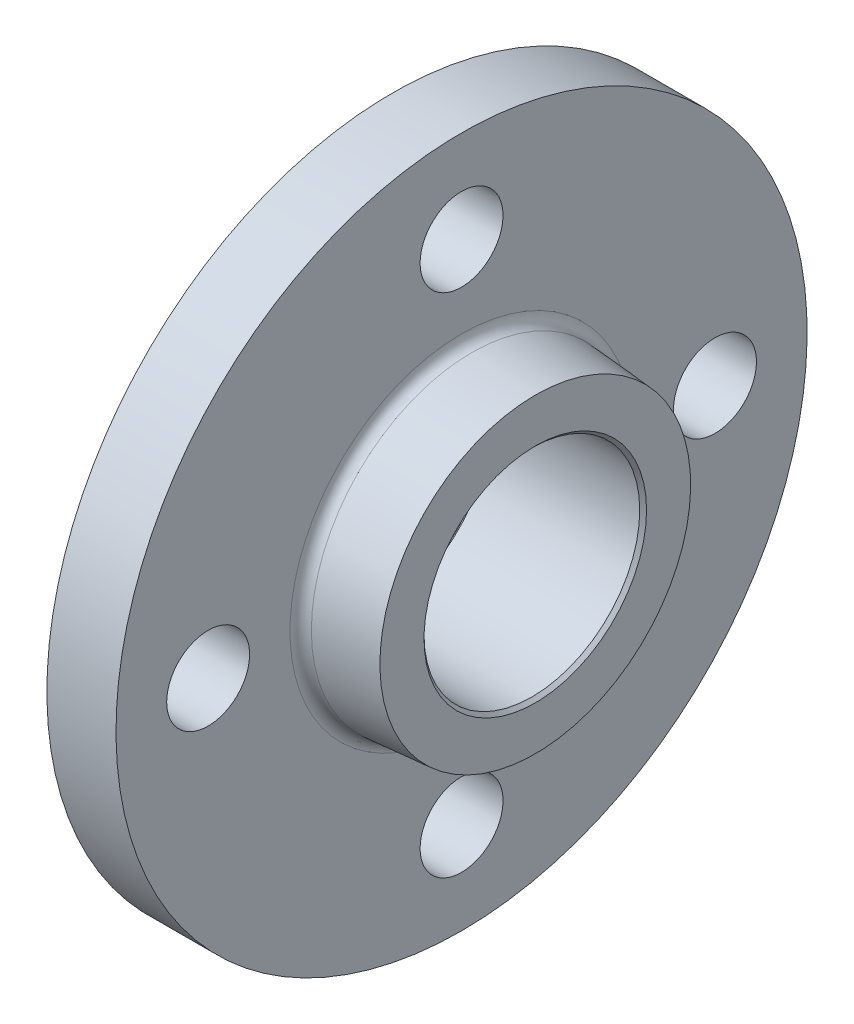
ISO-10303-21;
HEADER;
FILE_DESCRIPTION(('STEP AP214'),'2;1');
FILE_NAME('part.step','',(''),(''),'','','');
FILE_SCHEMA(('AUTOMOTIVE_DESIGN { 1 0 10303 214 1 1 1 1 }'));
ENDSEC;
DATA;
#1=APPLICATION_CONTEXT('core data for automotive mechanical design processes');
#2=APPLICATION_PROTOCOL_DEFINITION('international standard','automotive_design',2000,#1);
#3=PRODUCT_CONTEXT('',#1,'mechanical');
#4=PRODUCT('Part','Part','',(#3));
#5=PRODUCT_RELATED_PRODUCT_CATEGORY('part','',(#4));
#6=PRODUCT_DEFINITION_FORMATION('','',#4);
#7=PRODUCT_DEFINITION_CONTEXT('part definition',#1,'design');
#8=PRODUCT_DEFINITION('design','',#6,#7);
#9=PRODUCT_DEFINITION_SHAPE('','',#8);
#10=(LENGTH_UNIT() NAMED_UNIT(*) SI_UNIT(.MILLI.,.METRE.));
#11=(NAMED_UNIT(*) PLANE_ANGLE_UNIT() SI_UNIT($,.RADIAN.));
#12=(NAMED_UNIT(*) SI_UNIT($,.STERADIAN.) SOLID_ANGLE_UNIT());
#13=UNCERTAINTY_MEASURE_WITH_UNIT(LENGTH_MEASURE(1.E-05),#10,'distance_accuracy_value','');
#14=(GEOMETRIC_REPRESENTATION_CONTEXT(3) GLOBAL_UNCERTAINTY_ASSIGNED_CONTEXT((#13)) GLOBAL_UNIT_ASSIGNED_CONTEXT((#10,
#11,#12)) REPRESENTATION_CONTEXT('',''));
#15=CARTESIAN_POINT('',(0.,0.,0.));
#16=DIRECTION('',(0.,0.,1.));
#17=DIRECTION('',(1.,0.,0.));
#18=AXIS2_PLACEMENT_3D('',#15,#16,#17);
#19=CARTESIAN_POINT('',(18.,0.,0.));
#20=DIRECTION('',(-1.,0.,0.));
#21=DIRECTION('',(0.,-1.,0.));
#22=AXIS2_PLACEMENT_3D('',#19,#20,#21);
#23=CYLINDRICAL_SURFACE('',#22,75.);
#24=CARTESIAN_POINT('',(18.,0.,0.));
#25=DIRECTION('',(-1.,0.,0.));
#26=DIRECTION('',(0.,-1.,0.));
#27=AXIS2_PLACEMENT_3D('',#24,#25,#26);
#28=CIRCLE('',#27,75.);
#29=CARTESIAN_POINT('',(18.,-75.,0.));
#30=VERTEX_POINT('',#29);
#31=EDGE_CURVE('E59',#30,#30,#28,.T.);
#32=ORIENTED_EDGE('',*,*,#31,.T.);
#33=EDGE_LOOP('',(#32));
#34=FACE_BOUND('',#33,.T.);
#35=CARTESIAN_POINT('',(3.,0.,0.));
#36=DIRECTION('',(-1.,0.,0.));
#37=DIRECTION('',(0.,-1.,0.));
#38=AXIS2_PLACEMENT_3D('',#35,#36,#37);
#39=CIRCLE('',#38,75.);
#40=CARTESIAN_POINT('',(3.,-75.,0.));
#41=VERTEX_POINT('',#40);
#42=EDGE_CURVE('E62',#41,#41,#39,.T.);
#43=ORIENTED_EDGE('',*,*,#42,.F.);
#44=EDGE_LOOP('',(#43));
#45=FACE_BOUND('',#44,.T.);
#46=ADVANCED_FACE('F32',(#34,#45),#23,.T.);
#47=CARTESIAN_POINT('',(18.,75.,0.));
#48=DIRECTION('',(1.,0.,0.));
#49=DIRECTION('',(0.,1.,0.));
#50=AXIS2_PLACEMENT_3D('',#47,#48,#49);
#51=PLANE('',#50);
#52=CARTESIAN_POINT('',(18.,0.,0.));
#53=DIRECTION('',(1.,0.,0.));
#54=DIRECTION('',(0.,1.,0.));
#55=AXIS2_PLACEMENT_3D('',#52,#53,#54);
#56=CIRCLE('',#55,37.2295156746098);
#57=CARTESIAN_POINT('',(18.,37.2295156746098,0.));
#58=VERTEX_POINT('',#57);
#59=EDGE_CURVE('E10',#58,#58,#56,.F.);
#60=ORIENTED_EDGE('',*,*,#59,.T.);
#61=EDGE_LOOP('',(#60));
#62=FACE_BOUND('',#61,.T.);
#63=CARTESIAN_POINT('',(18.,-55.,0.));
#64=DIRECTION('',(1.,0.,0.));
#65=DIRECTION('',(0.,1.,0.));
#66=AXIS2_PLACEMENT_3D('',#63,#64,#65);
#67=CIRCLE('',#66,8.99999999999999);
#68=CARTESIAN_POINT('',(18.,-46.,0.));
#69=VERTEX_POINT('',#68);
#70=EDGE_CURVE('E91',#69,#69,#67,.T.);
#71=ORIENTED_EDGE('',*,*,#70,.F.);
#72=EDGE_LOOP('',(#71));
#73=FACE_BOUND('',#72,.T.);
#74=CARTESIAN_POINT('',(18.,0.,-55.));
#75=DIRECTION('',(1.,0.,0.));
#76=DIRECTION('',(0.,1.,0.));
#77=AXIS2_PLACEMENT_3D('',#74,#75,#76);
#78=CIRCLE('',#77,8.99999999999999);
#79=CARTESIAN_POINT('',(18.,8.99999999999998,-55.));
#80=VERTEX_POINT('',#79);
#81=EDGE_CURVE('E85',#80,#80,#78,.T.);
#82=ORIENTED_EDGE('',*,*,#81,.F.);
#83=EDGE_LOOP('',(#82));
#84=FACE_BOUND('',#83,.T.);
#85=CARTESIAN_POINT('',(18.,55.,0.));
#86=DIRECTION('',(1.,0.,0.));
#87=DIRECTION('',(0.,1.,0.));
#88=AXIS2_PLACEMENT_3D('',#85,#86,#87);
#89=CIRCLE('',#88,8.99999999999999);
#90=CARTESIAN_POINT('',(18.,64.,0.));
#91=VERTEX_POINT('',#90);
#92=EDGE_CURVE('E79',#91,#91,#89,.T.);
#93=ORIENTED_EDGE('',*,*,#92,.F.);
#94=EDGE_LOOP('',(#93));
#95=FACE_BOUND('',#94,.T.);
#96=CARTESIAN_POINT('',(18.,0.,55.));
#97=DIRECTION('',(1.,0.,0.));
#98=DIRECTION('',(0.,1.,0.));
#99=AXIS2_PLACEMENT_3D('',#96,#97,#98);
#100=CIRCLE('',#99,8.99999999999999);
#101=CARTESIAN_POINT('',(18.,9.,55.));
#102=VERTEX_POINT('',#101);
#103=EDGE_CURVE('E73',#102,#102,#100,.T.);
#104=ORIENTED_EDGE('',*,*,#103,.F.);
#105=EDGE_LOOP('',(#104));
#106=FACE_BOUND('',#105,.T.);
#107=ORIENTED_EDGE('',*,*,#31,.F.);
#108=EDGE_LOOP('',(#107));
#109=FACE_BOUND('',#108,.T.);
#110=ADVANCED_FACE('F104',(#62,#73,#84,#95,#106,#109),#51,.T.);
#111=CARTESIAN_POINT('',(3.,0.,0.));
#112=DIRECTION('',(-1.,0.,0.));
#113=DIRECTION('',(0.,-1.,0.));
#114=AXIS2_PLACEMENT_3D('',#111,#112,#113);
#115=PLANE('',#114);
#116=CARTESIAN_POINT('',(3.,-55.,0.));
#117=DIRECTION('',(-1.,0.,0.));
#118=DIRECTION('',(0.,0.,1.));
#119=AXIS2_PLACEMENT_3D('',#116,#117,#118);
#120=CIRCLE('',#119,8.99999999999999);
#121=CARTESIAN_POINT('',(3.,-55.,8.99999999999999));
#122=VERTEX_POINT('',#121);
#123=EDGE_CURVE('E94',#122,#122,#120,.T.);
#124=ORIENTED_EDGE('',*,*,#123,.F.);
#125=EDGE_LOOP('',(#124));
#126=FACE_BOUND('',#125,.T.);
#127=CARTESIAN_POINT('',(3.,0.,-55.));
#128=DIRECTION('',(-1.,0.,0.));
#129=DIRECTION('',(0.,0.,1.));
#130=AXIS2_PLACEMENT_3D('',#127,#128,#129);
#131=CIRCLE('',#130,8.99999999999999);
#132=CARTESIAN_POINT('',(3.,0.,-46.));
#133=VERTEX_POINT('',#132);
#134=EDGE_CURVE('E88',#133,#133,#131,.T.);
#135=ORIENTED_EDGE('',*,*,#134,.F.);
#136=EDGE_LOOP('',(#135));
#137=FACE_BOUND('',#136,.T.);
#138=CARTESIAN_POINT('',(2.99999999999999,55.,0.));
#139=DIRECTION('',(-1.,0.,0.));
#140=DIRECTION('',(0.,0.,1.));
#141=AXIS2_PLACEMENT_3D('',#138,#139,#140);
#142=CIRCLE('',#141,8.99999999999999);
#143=CARTESIAN_POINT('',(2.99999999999999,55.,8.99999999999998));
#144=VERTEX_POINT('',#143);
#145=EDGE_CURVE('E82',#144,#144,#142,.T.);
#146=ORIENTED_EDGE('',*,*,#145,.F.);
#147=EDGE_LOOP('',(#146));
#148=FACE_BOUND('',#147,.T.);
#149=CARTESIAN_POINT('',(3.,0.,55.));
#150=DIRECTION('',(-1.,0.,0.));
#151=DIRECTION('',(0.,0.,1.));
#152=AXIS2_PLACEMENT_3D('',#149,#150,#151);
#153=CIRCLE('',#152,8.99999999999999);
#154=CARTESIAN_POINT('',(3.,0.,64.));
#155=VERTEX_POINT('',#154);
#156=EDGE_CURVE('E76',#155,#155,#153,.T.);
#157=ORIENTED_EDGE('',*,*,#156,.F.);
#158=EDGE_LOOP('',(#157));
#159=FACE_BOUND('',#158,.T.);
#160=CARTESIAN_POINT('',(3.,0.,0.));
#161=DIRECTION('',(-1.,0.,0.));
#162=DIRECTION('',(0.,-1.,0.));
#163=AXIS2_PLACEMENT_3D('',#160,#161,#162);
#164=CIRCLE('',#163,44.);
#165=CARTESIAN_POINT('',(3.,-44.,0.));
#166=VERTEX_POINT('',#165);
#167=EDGE_CURVE('E58',#166,#166,#164,.T.);
#168=ORIENTED_EDGE('',*,*,#167,.F.);
#169=EDGE_LOOP('',(#168));
#170=FACE_BOUND('',#169,.T.);
#171=ORIENTED_EDGE('',*,*,#42,.T.);
#172=EDGE_LOOP('',(#171));
#173=FACE_BOUND('',#172,.T.);
#174=ADVANCED_FACE('F100',(#126,#137,#148,#159,#170,#173),#115,.T.);
#175=CARTESIAN_POINT('',(0.,0.,0.));
#176=DIRECTION('',(1.,0.,0.));
#177=DIRECTION('',(0.,1.,0.));
#178=AXIS2_PLACEMENT_3D('',#175,#176,#177);
#179=CYLINDRICAL_SURFACE('',#178,44.);
#180=CARTESIAN_POINT('',(0.,0.,0.));
#181=DIRECTION('',(-1.,0.,0.));
#182=DIRECTION('',(0.,-1.,0.));
#183=AXIS2_PLACEMENT_3D('',#180,#181,#182);
#184=CIRCLE('',#183,44.);
#185=CARTESIAN_POINT('',(0.,-44.,0.));
#186=VERTEX_POINT('',#185);
#187=EDGE_CURVE('E65',#186,#186,#184,.T.);
#188=ORIENTED_EDGE('',*,*,#187,.F.);
#189=EDGE_LOOP('',(#188));
#190=FACE_BOUND('',#189,.T.);
#191=ORIENTED_EDGE('',*,*,#167,.T.);
#192=EDGE_LOOP('',(#191));
#193=FACE_BOUND('',#192,.T.);
#194=ADVANCED_FACE('F103',(#190,#193),#179,.T.);
#195=CARTESIAN_POINT('',(0.,0.,0.));
#196=DIRECTION('',(-1.,0.,0.));
#197=DIRECTION('',(0.,-1.,0.));
#198=AXIS2_PLACEMENT_3D('',#195,#196,#197);
#199=PLANE('',#198);
#200=CARTESIAN_POINT('',(0.,0.,0.));
#201=DIRECTION('',(-1.,0.,0.));
#202=DIRECTION('',(0.,-1.,0.));
#203=AXIS2_PLACEMENT_3D('',#200,#201,#202);
#204=CIRCLE('',#203,24.15);
#205=CARTESIAN_POINT('',(0.,-24.15,0.));
#206=VERTEX_POINT('',#205);
#207=EDGE_CURVE('E55',#206,#206,#204,.F.);
#208=ORIENTED_EDGE('',*,*,#207,.T.);
#209=EDGE_LOOP('',(#208));
#210=FACE_BOUND('',#209,.T.);
#211=ORIENTED_EDGE('',*,*,#187,.T.);
#212=EDGE_LOOP('',(#211));
#213=FACE_BOUND('',#212,.T.);
#214=ADVANCED_FACE('F167',(#210,#213),#199,.T.);
#215=CARTESIAN_POINT('',(18.,0.,0.));
#216=DIRECTION('',(-1.,0.,0.));
#217=DIRECTION('',(0.,1.,0.));
#218=AXIS2_PLACEMENT_3D('',#215,#216,#217);
#219=CONICAL_SURFACE('',#218,35.,0.0798299857122315);
#220=CARTESIAN_POINT('',(20.2224152881869,0.,0.));
#221=DIRECTION('',(1.,0.,0.));
#222=DIRECTION('',(0.,1.,0.));
#223=AXIS2_PLACEMENT_3D('',#220,#221,#222);
#224=CIRCLE('',#223,34.8222067769451);
#225=CARTESIAN_POINT('',(20.2224152881869,34.8222067769451,0.));
#226=VERTEX_POINT('',#225);
#227=EDGE_CURVE('E39',#226,#226,#224,.T.);
#228=ORIENTED_EDGE('',*,*,#227,.T.);
#229=EDGE_LOOP('',(#228));
#230=FACE_BOUND('',#229,.T.);
#231=CARTESIAN_POINT('',(34.,0.,0.));
#232=DIRECTION('',(1.,0.,0.));
#233=DIRECTION('',(0.,1.,0.));
#234=AXIS2_PLACEMENT_3D('',#231,#232,#233);
#235=CIRCLE('',#234,33.7200000000001);
#236=CARTESIAN_POINT('',(34.,33.7200000000001,0.));
#237=VERTEX_POINT('',#236);
#238=EDGE_CURVE('E70',#237,#237,#235,.T.);
#239=ORIENTED_EDGE('',*,*,#238,.F.);
#240=EDGE_LOOP('',(#239));
#241=FACE_BOUND('',#240,.T.);
#242=ADVANCED_FACE('F163',(#230,#241),#219,.T.);
#243=CARTESIAN_POINT('',(34.,0.,0.));
#244=DIRECTION('',(1.,0.,0.));
#245=DIRECTION('',(0.,1.,0.));
#246=AXIS2_PLACEMENT_3D('',#243,#244,#245);
#247=PLANE('',#246);
#248=CARTESIAN_POINT('',(34.,0.,0.));
#249=DIRECTION('',(1.,0.,0.));
#250=DIRECTION('',(0.,1.,0.));
#251=AXIS2_PLACEMENT_3D('',#248,#249,#250);
#252=CIRCLE('',#251,24.1500000000001);
#253=CARTESIAN_POINT('',(34.,24.1500000000001,0.));
#254=VERTEX_POINT('',#253);
#255=EDGE_CURVE('E43',#254,#254,#252,.F.);
#256=ORIENTED_EDGE('',*,*,#255,.T.);
#257=EDGE_LOOP('',(#256));
#258=FACE_BOUND('',#257,.T.);
#259=ORIENTED_EDGE('',*,*,#238,.T.);
#260=EDGE_LOOP('',(#259));
#261=FACE_BOUND('',#260,.T.);
#262=ADVANCED_FACE('F159',(#258,#261),#247,.T.);
#263=CARTESIAN_POINT('',(3.,0.,55.));
#264=DIRECTION('',(-1.,0.,0.));
#265=DIRECTION('',(0.,0.,1.));
#266=AXIS2_PLACEMENT_3D('',#263,#264,#265);
#267=CYLINDRICAL_SURFACE('',#266,8.99999999999999);
#268=ORIENTED_EDGE('',*,*,#103,.T.);
#269=EDGE_LOOP('',(#268));
#270=FACE_BOUND('',#269,.T.);
#271=ORIENTED_EDGE('',*,*,#156,.T.);
#272=EDGE_LOOP('',(#271));
#273=FACE_BOUND('',#272,.T.);
#274=ADVANCED_FACE('F155',(#270,#273),#267,.F.);
#275=CARTESIAN_POINT('',(2.99999999999999,55.,0.));
#276=DIRECTION('',(-1.,0.,0.));
#277=DIRECTION('',(0.,0.,1.));
#278=AXIS2_PLACEMENT_3D('',#275,#276,#277);
#279=CYLINDRICAL_SURFACE('',#278,8.99999999999999);
#280=ORIENTED_EDGE('',*,*,#92,.T.);
#281=EDGE_LOOP('',(#280));
#282=FACE_BOUND('',#281,.T.);
#283=ORIENTED_EDGE('',*,*,#145,.T.);
#284=EDGE_LOOP('',(#283));
#285=FACE_BOUND('',#284,.T.);
#286=ADVANCED_FACE('F151',(#282,#285),#279,.F.);
#287=CARTESIAN_POINT('',(3.,0.,-55.));
#288=DIRECTION('',(-1.,0.,0.));
#289=DIRECTION('',(0.,0.,1.));
#290=AXIS2_PLACEMENT_3D('',#287,#288,#289);
#291=CYLINDRICAL_SURFACE('',#290,8.99999999999999);
#292=ORIENTED_EDGE('',*,*,#81,.T.);
#293=EDGE_LOOP('',(#292));
#294=FACE_BOUND('',#293,.T.);
#295=ORIENTED_EDGE('',*,*,#134,.T.);
#296=EDGE_LOOP('',(#295));
#297=FACE_BOUND('',#296,.T.);
#298=ADVANCED_FACE('F145',(#294,#297),#291,.F.);
#299=CARTESIAN_POINT('',(3.,-55.,0.));
#300=DIRECTION('',(-1.,0.,0.));
#301=DIRECTION('',(0.,0.,1.));
#302=AXIS2_PLACEMENT_3D('',#299,#300,#301);
#303=CYLINDRICAL_SURFACE('',#302,8.99999999999999);
#304=ORIENTED_EDGE('',*,*,#70,.T.);
#305=EDGE_LOOP('',(#304));
#306=FACE_BOUND('',#305,.T.);
#307=ORIENTED_EDGE('',*,*,#123,.T.);
#308=EDGE_LOOP('',(#307));
#309=FACE_BOUND('',#308,.T.);
#310=ADVANCED_FACE('F98',(#306,#309),#303,.F.);
#311=CARTESIAN_POINT('',(34.,0.,0.));
#312=DIRECTION('',(1.,0.,0.));
#313=DIRECTION('',(0.,0.,-1.));
#314=AXIS2_PLACEMENT_3D('',#311,#312,#313);
#315=CYLINDRICAL_SURFACE('',#314,23.4104535);
#316=CARTESIAN_POINT('',(0.739546500000007,0.,0.));
#317=DIRECTION('',(-1.,0.,0.));
#318=DIRECTION('',(0.,0.,1.));
#319=AXIS2_PLACEMENT_3D('',#316,#317,#318);
#320=CIRCLE('',#319,23.4104535);
#321=CARTESIAN_POINT('',(0.739546500000007,0.,23.4104535));
#322=VERTEX_POINT('',#321);
#323=EDGE_CURVE('E47',#322,#322,#320,.T.);
#324=ORIENTED_EDGE('',*,*,#323,.T.);
#325=EDGE_LOOP('',(#324));
#326=FACE_BOUND('',#325,.T.);
#327=CARTESIAN_POINT('',(33.2604534999999,0.,0.));
#328=DIRECTION('',(1.,0.,0.));
#329=DIRECTION('',(0.,0.,-1.));
#330=AXIS2_PLACEMENT_3D('',#327,#328,#329);
#331=CIRCLE('',#330,23.4104535);
#332=CARTESIAN_POINT('',(33.2604534999999,0.,-23.4104535));
#333=VERTEX_POINT('',#332);
#334=EDGE_CURVE('E52',#333,#333,#331,.T.);
#335=ORIENTED_EDGE('',*,*,#334,.T.);
#336=EDGE_LOOP('',(#335));
#337=FACE_BOUND('',#336,.T.);
#338=ADVANCED_FACE('F127',(#326,#337),#315,.F.);
#339=CARTESIAN_POINT('',(0.,0.,0.));
#340=DIRECTION('',(-1.,0.,0.));
#341=DIRECTION('',(0.,0.,1.));
#342=AXIS2_PLACEMENT_3D('',#339,#340,#341);
#343=CONICAL_SURFACE('',#342,24.15,0.785398163397444);
#344=ORIENTED_EDGE('',*,*,#323,.F.);
#345=EDGE_LOOP('',(#344));
#346=FACE_BOUND('',#345,.T.);
#347=ORIENTED_EDGE('',*,*,#207,.F.);
#348=EDGE_LOOP('',(#347));
#349=FACE_BOUND('',#348,.T.);
#350=ADVANCED_FACE('F124',(#346,#349),#343,.F.);
#351=CARTESIAN_POINT('',(33.2604534999999,0.,0.));
#352=DIRECTION('',(1.,0.,0.));
#353=DIRECTION('',(0.,0.,-1.));
#354=AXIS2_PLACEMENT_3D('',#351,#352,#353);
#355=CONICAL_SURFACE('',#354,23.4104535,0.785398163397434);
#356=ORIENTED_EDGE('',*,*,#255,.F.);
#357=EDGE_LOOP('',(#356));
#358=FACE_BOUND('',#357,.T.);
#359=ORIENTED_EDGE('',*,*,#334,.F.);
#360=EDGE_LOOP('',(#359));
#361=FACE_BOUND('',#360,.T.);
#362=ADVANCED_FACE('F126',(#358,#361),#355,.F.);
#363=CARTESIAN_POINT('',(20.415,0.,0.));
#364=DIRECTION('',(1.,0.,0.));
#365=DIRECTION('',(0.,1.,0.));
#366=AXIS2_PLACEMENT_3D('',#363,#364,#365);
#367=TOROIDAL_SURFACE('',#366,37.2295156746098,2.415);
#368=ORIENTED_EDGE('',*,*,#59,.F.);
#369=EDGE_LOOP('',(#368));
#370=FACE_BOUND('',#369,.T.);
#371=ORIENTED_EDGE('',*,*,#227,.F.);
#372=EDGE_LOOP('',(#371));
#373=FACE_BOUND('',#372,.T.);
#374=ADVANCED_FACE('F34',(#370,#373),#367,.F.);
#375=CLOSED_SHELL('',(#46,#110,#174,#194,#214,#242,#262,#274,#286,#298,#310,#338,#350,#362,#374));
#376=MANIFOLD_SOLID_BREP('B2',#375);
#377=ADVANCED_BREP_SHAPE_REPRESENTATION('',(#18,#376),#14);
#378=SHAPE_DEFINITION_REPRESENTATION(#9,#377);
ENDSEC;
END-ISO-10303-21;
